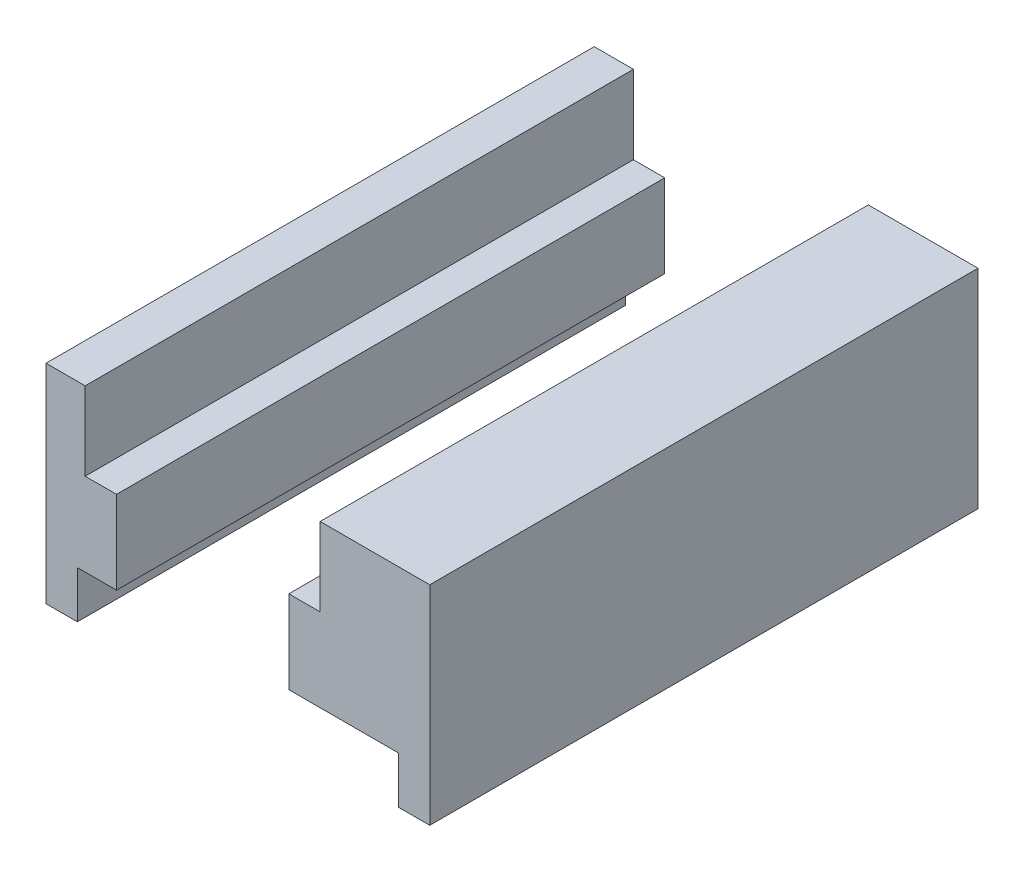
ISO-10303-21;
HEADER;
FILE_DESCRIPTION(('STEP AP214'),'2;1');
FILE_NAME('part.step','',(''),(''),'','','');
FILE_SCHEMA(('AUTOMOTIVE_DESIGN { 1 0 10303 214 1 1 1 1 }'));
ENDSEC;
DATA;
#1=APPLICATION_CONTEXT('core data for automotive mechanical design processes');
#2=APPLICATION_PROTOCOL_DEFINITION('international standard','automotive_design',2000,#1);
#3=PRODUCT_CONTEXT('',#1,'mechanical');
#4=PRODUCT('Part','Part','',(#3));
#5=PRODUCT_RELATED_PRODUCT_CATEGORY('part','',(#4));
#6=PRODUCT_DEFINITION_FORMATION('','',#4);
#7=PRODUCT_DEFINITION_CONTEXT('part definition',#1,'design');
#8=PRODUCT_DEFINITION('design','',#6,#7);
#9=PRODUCT_DEFINITION_SHAPE('','',#8);
#10=(LENGTH_UNIT() NAMED_UNIT(*) SI_UNIT(.MILLI.,.METRE.));
#11=(NAMED_UNIT(*) PLANE_ANGLE_UNIT() SI_UNIT($,.RADIAN.));
#12=(NAMED_UNIT(*) SI_UNIT($,.STERADIAN.) SOLID_ANGLE_UNIT());
#13=UNCERTAINTY_MEASURE_WITH_UNIT(LENGTH_MEASURE(1.E-05),#10,'distance_accuracy_value','');
#14=(GEOMETRIC_REPRESENTATION_CONTEXT(3) GLOBAL_UNCERTAINTY_ASSIGNED_CONTEXT((#13)) GLOBAL_UNIT_ASSIGNED_CONTEXT((#10,
#11,#12)) REPRESENTATION_CONTEXT('',''));
#15=CARTESIAN_POINT('',(0.,0.,0.));
#16=DIRECTION('',(0.,0.,1.));
#17=DIRECTION('',(1.,0.,0.));
#18=AXIS2_PLACEMENT_3D('',#15,#16,#17);
#19=CARTESIAN_POINT('',(12.25,0.,35.));
#20=DIRECTION('',(0.,1.,0.));
#21=DIRECTION('',(-1.,0.,0.));
#22=AXIS2_PLACEMENT_3D('',#19,#20,#21);
#23=PLANE('',#22);
#24=DIRECTION('',(1.,0.,0.));
#25=VECTOR('',#24,1.);
#26=CARTESIAN_POINT('',(12.25,0.,0.));
#27=LINE('',#26,#25);
#28=CARTESIAN_POINT('',(10.25,0.,0.));
#29=VERTEX_POINT('',#28);
#30=CARTESIAN_POINT('',(12.25,0.,0.));
#31=VERTEX_POINT('',#30);
#32=EDGE_CURVE('E12',#29,#31,#27,.T.);
#33=ORIENTED_EDGE('',*,*,#32,.T.);
#34=DIRECTION('',(0.,0.,-1.));
#35=VECTOR('',#34,1.);
#36=CARTESIAN_POINT('',(12.25,0.,35.));
#37=LINE('',#36,#35);
#38=CARTESIAN_POINT('',(12.25,0.,35.));
#39=VERTEX_POINT('',#38);
#40=EDGE_CURVE('E207',#39,#31,#37,.T.);
#41=ORIENTED_EDGE('',*,*,#40,.F.);
#42=DIRECTION('',(1.,0.,0.));
#43=VECTOR('',#42,1.);
#44=CARTESIAN_POINT('',(12.25,0.,35.));
#45=LINE('',#44,#43);
#46=CARTESIAN_POINT('',(10.25,0.,35.));
#47=VERTEX_POINT('',#46);
#48=EDGE_CURVE('E57',#47,#39,#45,.T.);
#49=ORIENTED_EDGE('',*,*,#48,.F.);
#50=DIRECTION('',(0.,0.,-1.));
#51=VECTOR('',#50,1.);
#52=CARTESIAN_POINT('',(10.25,0.,35.));
#53=LINE('',#52,#51);
#54=EDGE_CURVE('E164',#47,#29,#53,.T.);
#55=ORIENTED_EDGE('',*,*,#54,.T.);
#56=EDGE_LOOP('',(#33,#41,#49,#55));
#57=FACE_BOUND('',#56,.T.);
#58=ADVANCED_FACE('F53',(#57),#23,.F.);
#59=CARTESIAN_POINT('',(12.25,13.3,35.));
#60=DIRECTION('',(-1.,0.,0.));
#61=DIRECTION('',(0.,-1.,0.));
#62=AXIS2_PLACEMENT_3D('',#59,#60,#61);
#63=PLANE('',#62);
#64=DIRECTION('',(0.,1.,0.));
#65=VECTOR('',#64,1.);
#66=CARTESIAN_POINT('',(12.25,13.3,0.));
#67=LINE('',#66,#65);
#68=CARTESIAN_POINT('',(12.25,13.3,0.));
#69=VERTEX_POINT('',#68);
#70=EDGE_CURVE('E64',#31,#69,#67,.T.);
#71=ORIENTED_EDGE('',*,*,#70,.T.);
#72=DIRECTION('',(0.,0.,-1.));
#73=VECTOR('',#72,1.);
#74=CARTESIAN_POINT('',(12.25,13.3,35.));
#75=LINE('',#74,#73);
#76=CARTESIAN_POINT('',(12.25,13.3,35.));
#77=VERTEX_POINT('',#76);
#78=EDGE_CURVE('E134',#77,#69,#75,.T.);
#79=ORIENTED_EDGE('',*,*,#78,.F.);
#80=DIRECTION('',(0.,1.,0.));
#81=VECTOR('',#80,1.);
#82=CARTESIAN_POINT('',(12.25,13.3,35.));
#83=LINE('',#82,#81);
#84=EDGE_CURVE('E100',#39,#77,#83,.T.);
#85=ORIENTED_EDGE('',*,*,#84,.F.);
#86=ORIENTED_EDGE('',*,*,#40,.T.);
#87=EDGE_LOOP('',(#71,#79,#85,#86));
#88=FACE_BOUND('',#87,.T.);
#89=ADVANCED_FACE('F219',(#88),#63,.F.);
#90=CARTESIAN_POINT('',(5.25,13.3,35.));
#91=DIRECTION('',(0.,-1.,0.));
#92=DIRECTION('',(0.,0.,-1.));
#93=AXIS2_PLACEMENT_3D('',#90,#91,#92);
#94=PLANE('',#93);
#95=DIRECTION('',(-1.,0.,0.));
#96=VECTOR('',#95,1.);
#97=CARTESIAN_POINT('',(5.25,13.3,0.));
#98=LINE('',#97,#96);
#99=CARTESIAN_POINT('',(5.25,13.3,0.));
#100=VERTEX_POINT('',#99);
#101=EDGE_CURVE('E128',#69,#100,#98,.T.);
#102=ORIENTED_EDGE('',*,*,#101,.T.);
#103=DIRECTION('',(0.,0.,-1.));
#104=VECTOR('',#103,1.);
#105=CARTESIAN_POINT('',(5.25,13.3,35.));
#106=LINE('',#105,#104);
#107=CARTESIAN_POINT('',(5.25,13.3,35.));
#108=VERTEX_POINT('',#107);
#109=EDGE_CURVE('E132',#108,#100,#106,.T.);
#110=ORIENTED_EDGE('',*,*,#109,.F.);
#111=DIRECTION('',(-1.,0.,0.));
#112=VECTOR('',#111,1.);
#113=CARTESIAN_POINT('',(5.25,13.3,35.));
#114=LINE('',#113,#112);
#115=EDGE_CURVE('E175',#77,#108,#114,.T.);
#116=ORIENTED_EDGE('',*,*,#115,.F.);
#117=ORIENTED_EDGE('',*,*,#78,.T.);
#118=EDGE_LOOP('',(#102,#110,#116,#117));
#119=FACE_BOUND('',#118,.T.);
#120=ADVANCED_FACE('F130',(#119),#94,.F.);
#121=CARTESIAN_POINT('',(5.25,8.3,35.));
#122=DIRECTION('',(1.,0.,0.));
#123=DIRECTION('',(0.,0.,-1.));
#124=AXIS2_PLACEMENT_3D('',#121,#122,#123);
#125=PLANE('',#124);
#126=DIRECTION('',(0.,-1.,0.));
#127=VECTOR('',#126,1.);
#128=CARTESIAN_POINT('',(5.25,8.3,0.));
#129=LINE('',#128,#127);
#130=CARTESIAN_POINT('',(5.25,8.3,0.));
#131=VERTEX_POINT('',#130);
#132=EDGE_CURVE('E137',#100,#131,#129,.T.);
#133=ORIENTED_EDGE('',*,*,#132,.T.);
#134=DIRECTION('',(0.,0.,-1.));
#135=VECTOR('',#134,1.);
#136=CARTESIAN_POINT('',(5.25,8.3,35.));
#137=LINE('',#136,#135);
#138=CARTESIAN_POINT('',(5.25,8.3,35.));
#139=VERTEX_POINT('',#138);
#140=EDGE_CURVE('E145',#139,#131,#137,.T.);
#141=ORIENTED_EDGE('',*,*,#140,.F.);
#142=DIRECTION('',(0.,-1.,0.));
#143=VECTOR('',#142,1.);
#144=CARTESIAN_POINT('',(5.25,8.3,35.));
#145=LINE('',#144,#143);
#146=EDGE_CURVE('E143',#108,#139,#145,.T.);
#147=ORIENTED_EDGE('',*,*,#146,.F.);
#148=ORIENTED_EDGE('',*,*,#109,.T.);
#149=EDGE_LOOP('',(#133,#141,#147,#148));
#150=FACE_BOUND('',#149,.T.);
#151=ADVANCED_FACE('F140',(#150),#125,.F.);
#152=CARTESIAN_POINT('',(3.25,8.3,35.));
#153=DIRECTION('',(0.,-1.,0.));
#154=DIRECTION('',(0.,0.,-1.));
#155=AXIS2_PLACEMENT_3D('',#152,#153,#154);
#156=PLANE('',#155);
#157=DIRECTION('',(-1.,0.,0.));
#158=VECTOR('',#157,1.);
#159=CARTESIAN_POINT('',(3.25,8.3,0.));
#160=LINE('',#159,#158);
#161=CARTESIAN_POINT('',(3.25,8.3,0.));
#162=VERTEX_POINT('',#161);
#163=EDGE_CURVE('E150',#131,#162,#160,.T.);
#164=ORIENTED_EDGE('',*,*,#163,.T.);
#165=DIRECTION('',(0.,0.,-1.));
#166=VECTOR('',#165,1.);
#167=CARTESIAN_POINT('',(3.25,8.3,35.));
#168=LINE('',#167,#166);
#169=CARTESIAN_POINT('',(3.25,8.3,35.));
#170=VERTEX_POINT('',#169);
#171=EDGE_CURVE('E198',#170,#162,#168,.T.);
#172=ORIENTED_EDGE('',*,*,#171,.F.);
#173=DIRECTION('',(-1.,0.,0.));
#174=VECTOR('',#173,1.);
#175=CARTESIAN_POINT('',(3.25,8.3,35.));
#176=LINE('',#175,#174);
#177=EDGE_CURVE('E170',#139,#170,#176,.T.);
#178=ORIENTED_EDGE('',*,*,#177,.F.);
#179=ORIENTED_EDGE('',*,*,#140,.T.);
#180=EDGE_LOOP('',(#164,#172,#178,#179));
#181=FACE_BOUND('',#180,.T.);
#182=ADVANCED_FACE('F222',(#181),#156,.F.);
#183=CARTESIAN_POINT('',(3.25,3.,35.));
#184=DIRECTION('',(1.,0.,0.));
#185=DIRECTION('',(0.,0.,-1.));
#186=AXIS2_PLACEMENT_3D('',#183,#184,#185);
#187=PLANE('',#186);
#188=DIRECTION('',(0.,-1.,0.));
#189=VECTOR('',#188,1.);
#190=CARTESIAN_POINT('',(3.25,3.,0.));
#191=LINE('',#190,#189);
#192=CARTESIAN_POINT('',(3.25,3.,0.));
#193=VERTEX_POINT('',#192);
#194=EDGE_CURVE('E154',#162,#193,#191,.T.);
#195=ORIENTED_EDGE('',*,*,#194,.T.);
#196=DIRECTION('',(0.,0.,-1.));
#197=VECTOR('',#196,1.);
#198=CARTESIAN_POINT('',(3.25,3.,35.));
#199=LINE('',#198,#197);
#200=CARTESIAN_POINT('',(3.25,3.,35.));
#201=VERTEX_POINT('',#200);
#202=EDGE_CURVE('E195',#201,#193,#199,.T.);
#203=ORIENTED_EDGE('',*,*,#202,.F.);
#204=DIRECTION('',(0.,-1.,0.));
#205=VECTOR('',#204,1.);
#206=CARTESIAN_POINT('',(3.25,3.,35.));
#207=LINE('',#206,#205);
#208=EDGE_CURVE('E167',#170,#201,#207,.T.);
#209=ORIENTED_EDGE('',*,*,#208,.F.);
#210=ORIENTED_EDGE('',*,*,#171,.T.);
#211=EDGE_LOOP('',(#195,#203,#209,#210));
#212=FACE_BOUND('',#211,.T.);
#213=ADVANCED_FACE('F193',(#212),#187,.F.);
#214=CARTESIAN_POINT('',(10.25,3.,35.));
#215=DIRECTION('',(0.,1.,0.));
#216=DIRECTION('',(-1.,0.,0.));
#217=AXIS2_PLACEMENT_3D('',#214,#215,#216);
#218=PLANE('',#217);
#219=DIRECTION('',(1.,0.,0.));
#220=VECTOR('',#219,1.);
#221=CARTESIAN_POINT('',(10.25,3.,0.));
#222=LINE('',#221,#220);
#223=CARTESIAN_POINT('',(10.25,3.,0.));
#224=VERTEX_POINT('',#223);
#225=EDGE_CURVE('E182',#193,#224,#222,.T.);
#226=ORIENTED_EDGE('',*,*,#225,.T.);
#227=DIRECTION('',(0.,0.,-1.));
#228=VECTOR('',#227,1.);
#229=CARTESIAN_POINT('',(10.25,3.,35.));
#230=LINE('',#229,#228);
#231=CARTESIAN_POINT('',(10.25,3.,35.));
#232=VERTEX_POINT('',#231);
#233=EDGE_CURVE('E204',#232,#224,#230,.T.);
#234=ORIENTED_EDGE('',*,*,#233,.F.);
#235=DIRECTION('',(1.,0.,0.));
#236=VECTOR('',#235,1.);
#237=CARTESIAN_POINT('',(10.25,3.,35.));
#238=LINE('',#237,#236);
#239=EDGE_CURVE('E163',#201,#232,#238,.T.);
#240=ORIENTED_EDGE('',*,*,#239,.F.);
#241=ORIENTED_EDGE('',*,*,#202,.T.);
#242=EDGE_LOOP('',(#226,#234,#240,#241));
#243=FACE_BOUND('',#242,.T.);
#244=ADVANCED_FACE('F201',(#243),#218,.F.);
#245=CARTESIAN_POINT('',(10.25,0.,35.));
#246=DIRECTION('',(1.,0.,0.));
#247=DIRECTION('',(0.,0.,-1.));
#248=AXIS2_PLACEMENT_3D('',#245,#246,#247);
#249=PLANE('',#248);
#250=DIRECTION('',(0.,-1.,0.));
#251=VECTOR('',#250,1.);
#252=CARTESIAN_POINT('',(10.25,0.,0.));
#253=LINE('',#252,#251);
#254=EDGE_CURVE('E111',#224,#29,#253,.T.);
#255=ORIENTED_EDGE('',*,*,#254,.T.);
#256=ORIENTED_EDGE('',*,*,#54,.F.);
#257=DIRECTION('',(0.,-1.,0.));
#258=VECTOR('',#257,1.);
#259=CARTESIAN_POINT('',(10.25,0.,35.));
#260=LINE('',#259,#258);
#261=EDGE_CURVE('E160',#232,#47,#260,.T.);
#262=ORIENTED_EDGE('',*,*,#261,.F.);
#263=ORIENTED_EDGE('',*,*,#233,.T.);
#264=EDGE_LOOP('',(#255,#256,#262,#263));
#265=FACE_BOUND('',#264,.T.);
#266=ADVANCED_FACE('F223',(#265),#249,.F.);
#267=CARTESIAN_POINT('',(0.,0.,35.));
#268=DIRECTION('',(0.,0.,-1.));
#269=DIRECTION('',(-1.,0.,0.));
#270=AXIS2_PLACEMENT_3D('',#267,#268,#269);
#271=PLANE('',#270);
#272=ORIENTED_EDGE('',*,*,#48,.T.);
#273=ORIENTED_EDGE('',*,*,#84,.T.);
#274=ORIENTED_EDGE('',*,*,#115,.T.);
#275=ORIENTED_EDGE('',*,*,#146,.T.);
#276=ORIENTED_EDGE('',*,*,#177,.T.);
#277=ORIENTED_EDGE('',*,*,#208,.T.);
#278=ORIENTED_EDGE('',*,*,#239,.T.);
#279=ORIENTED_EDGE('',*,*,#261,.T.);
#280=EDGE_LOOP('',(#272,#273,#274,#275,#276,#277,#278,#279));
#281=FACE_BOUND('',#280,.T.);
#282=ADVANCED_FACE('F55',(#281),#271,.F.);
#283=CARTESIAN_POINT('',(0.,0.,0.));
#284=DIRECTION('',(0.,0.,-1.));
#285=DIRECTION('',(-1.,0.,0.));
#286=AXIS2_PLACEMENT_3D('',#283,#284,#285);
#287=PLANE('',#286);
#288=ORIENTED_EDGE('',*,*,#32,.F.);
#289=ORIENTED_EDGE('',*,*,#254,.F.);
#290=ORIENTED_EDGE('',*,*,#225,.F.);
#291=ORIENTED_EDGE('',*,*,#194,.F.);
#292=ORIENTED_EDGE('',*,*,#163,.F.);
#293=ORIENTED_EDGE('',*,*,#132,.F.);
#294=ORIENTED_EDGE('',*,*,#101,.F.);
#295=ORIENTED_EDGE('',*,*,#70,.F.);
#296=EDGE_LOOP('',(#288,#289,#290,#291,#292,#293,#294,#295));
#297=FACE_BOUND('',#296,.T.);
#298=ADVANCED_FACE('F148',(#297),#287,.T.);
#299=CLOSED_SHELL('',(#58,#89,#120,#151,#182,#213,#244,#266,#282,#298));
#300=MANIFOLD_SOLID_BREP('B2',#299);
#301=CARTESIAN_POINT('',(-12.25,13.3,35.));
#302=DIRECTION('',(1.,0.,0.));
#303=DIRECTION('',(0.,1.,0.));
#304=AXIS2_PLACEMENT_3D('',#301,#302,#303);
#305=PLANE('',#304);
#306=DIRECTION('',(0.,-1.,0.));
#307=VECTOR('',#306,1.);
#308=CARTESIAN_POINT('',(-12.25,13.3,0.));
#309=LINE('',#308,#307);
#310=CARTESIAN_POINT('',(-12.25,13.3,0.));
#311=VERTEX_POINT('',#310);
#312=CARTESIAN_POINT('',(-12.25,0.,0.));
#313=VERTEX_POINT('',#312);
#314=EDGE_CURVE('E421',#311,#313,#309,.T.);
#315=ORIENTED_EDGE('',*,*,#314,.T.);
#316=DIRECTION('',(0.,0.,-1.));
#317=VECTOR('',#316,1.);
#318=CARTESIAN_POINT('',(-12.25,0.,35.));
#319=LINE('',#318,#317);
#320=CARTESIAN_POINT('',(-12.25,0.,35.));
#321=VERTEX_POINT('',#320);
#322=EDGE_CURVE('E51',#321,#313,#319,.T.);
#323=ORIENTED_EDGE('',*,*,#322,.F.);
#324=DIRECTION('',(0.,-1.,0.));
#325=VECTOR('',#324,1.);
#326=CARTESIAN_POINT('',(-12.25,13.3,35.));
#327=LINE('',#326,#325);
#328=CARTESIAN_POINT('',(-12.25,13.3,35.));
#329=VERTEX_POINT('',#328);
#330=EDGE_CURVE('E435',#329,#321,#327,.T.);
#331=ORIENTED_EDGE('',*,*,#330,.F.);
#332=DIRECTION('',(0.,0.,-1.));
#333=VECTOR('',#332,1.);
#334=CARTESIAN_POINT('',(-12.25,13.3,35.));
#335=LINE('',#334,#333);
#336=EDGE_CURVE('E417',#329,#311,#335,.T.);
#337=ORIENTED_EDGE('',*,*,#336,.T.);
#338=EDGE_LOOP('',(#315,#323,#331,#337));
#339=FACE_BOUND('',#338,.T.);
#340=ADVANCED_FACE('F325',(#339),#305,.F.);
#341=CARTESIAN_POINT('',(-12.25,0.,35.));
#342=DIRECTION('',(0.,1.,0.));
#343=DIRECTION('',(0.,0.,1.));
#344=AXIS2_PLACEMENT_3D('',#341,#342,#343);
#345=PLANE('',#344);
#346=DIRECTION('',(1.,0.,0.));
#347=VECTOR('',#346,1.);
#348=CARTESIAN_POINT('',(-12.25,0.,0.));
#349=LINE('',#348,#347);
#350=CARTESIAN_POINT('',(-10.25,0.,0.));
#351=VERTEX_POINT('',#350);
#352=EDGE_CURVE('E424',#313,#351,#349,.T.);
#353=ORIENTED_EDGE('',*,*,#352,.T.);
#354=DIRECTION('',(0.,0.,-1.));
#355=VECTOR('',#354,1.);
#356=CARTESIAN_POINT('',(-10.25,0.,35.));
#357=LINE('',#356,#355);
#358=CARTESIAN_POINT('',(-10.25,0.,35.));
#359=VERTEX_POINT('',#358);
#360=EDGE_CURVE('E333',#359,#351,#357,.T.);
#361=ORIENTED_EDGE('',*,*,#360,.F.);
#362=DIRECTION('',(1.,0.,0.));
#363=VECTOR('',#362,1.);
#364=CARTESIAN_POINT('',(-12.25,0.,35.));
#365=LINE('',#364,#363);
#366=EDGE_CURVE('E384',#321,#359,#365,.T.);
#367=ORIENTED_EDGE('',*,*,#366,.F.);
#368=ORIENTED_EDGE('',*,*,#322,.T.);
#369=EDGE_LOOP('',(#353,#361,#367,#368));
#370=FACE_BOUND('',#369,.T.);
#371=ADVANCED_FACE('F470',(#370),#345,.F.);
#372=CARTESIAN_POINT('',(-10.25,3.,35.));
#373=DIRECTION('',(-1.,0.,0.));
#374=DIRECTION('',(0.,0.,1.));
#375=AXIS2_PLACEMENT_3D('',#372,#373,#374);
#376=PLANE('',#375);
#377=DIRECTION('',(0.,1.,0.));
#378=VECTOR('',#377,1.);
#379=CARTESIAN_POINT('',(-10.25,3.,0.));
#380=LINE('',#379,#378);
#381=CARTESIAN_POINT('',(-10.25,3.,0.));
#382=VERTEX_POINT('',#381);
#383=EDGE_CURVE('E426',#351,#382,#380,.T.);
#384=ORIENTED_EDGE('',*,*,#383,.T.);
#385=DIRECTION('',(0.,0.,-1.));
#386=VECTOR('',#385,1.);
#387=CARTESIAN_POINT('',(-10.25,3.,35.));
#388=LINE('',#387,#386);
#389=CARTESIAN_POINT('',(-10.25,3.,35.));
#390=VERTEX_POINT('',#389);
#391=EDGE_CURVE('E442',#390,#382,#388,.T.);
#392=ORIENTED_EDGE('',*,*,#391,.F.);
#393=DIRECTION('',(0.,1.,0.));
#394=VECTOR('',#393,1.);
#395=CARTESIAN_POINT('',(-10.25,3.,35.));
#396=LINE('',#395,#394);
#397=EDGE_CURVE('E450',#359,#390,#396,.T.);
#398=ORIENTED_EDGE('',*,*,#397,.F.);
#399=ORIENTED_EDGE('',*,*,#360,.T.);
#400=EDGE_LOOP('',(#384,#392,#398,#399));
#401=FACE_BOUND('',#400,.T.);
#402=ADVANCED_FACE('F448',(#401),#376,.F.);
#403=CARTESIAN_POINT('',(-7.75,3.,35.));
#404=DIRECTION('',(0.,1.,0.));
#405=DIRECTION('',(-1.,0.,0.));
#406=AXIS2_PLACEMENT_3D('',#403,#404,#405);
#407=PLANE('',#406);
#408=DIRECTION('',(1.,0.,0.));
#409=VECTOR('',#408,1.);
#410=CARTESIAN_POINT('',(-7.75,3.,0.));
#411=LINE('',#410,#409);
#412=CARTESIAN_POINT('',(-7.75,3.,0.));
#413=VERTEX_POINT('',#412);
#414=EDGE_CURVE('E428',#382,#413,#411,.T.);
#415=ORIENTED_EDGE('',*,*,#414,.T.);
#416=DIRECTION('',(0.,0.,-1.));
#417=VECTOR('',#416,1.);
#418=CARTESIAN_POINT('',(-7.75,3.,35.));
#419=LINE('',#418,#417);
#420=CARTESIAN_POINT('',(-7.75,3.,35.));
#421=VERTEX_POINT('',#420);
#422=EDGE_CURVE('E439',#421,#413,#419,.T.);
#423=ORIENTED_EDGE('',*,*,#422,.F.);
#424=DIRECTION('',(1.,0.,0.));
#425=VECTOR('',#424,1.);
#426=CARTESIAN_POINT('',(-7.75,3.,35.));
#427=LINE('',#426,#425);
#428=EDGE_CURVE('E462',#390,#421,#427,.T.);
#429=ORIENTED_EDGE('',*,*,#428,.F.);
#430=ORIENTED_EDGE('',*,*,#391,.T.);
#431=EDGE_LOOP('',(#415,#423,#429,#430));
#432=FACE_BOUND('',#431,.T.);
#433=ADVANCED_FACE('F458',(#432),#407,.F.);
#434=CARTESIAN_POINT('',(-7.75,8.3,35.));
#435=DIRECTION('',(-1.,0.,0.));
#436=DIRECTION('',(0.,-1.,0.));
#437=AXIS2_PLACEMENT_3D('',#434,#435,#436);
#438=PLANE('',#437);
#439=DIRECTION('',(0.,1.,0.));
#440=VECTOR('',#439,1.);
#441=CARTESIAN_POINT('',(-7.75,8.3,0.));
#442=LINE('',#441,#440);
#443=CARTESIAN_POINT('',(-7.75,8.3,0.));
#444=VERTEX_POINT('',#443);
#445=EDGE_CURVE('E430',#413,#444,#442,.T.);
#446=ORIENTED_EDGE('',*,*,#445,.T.);
#447=DIRECTION('',(0.,0.,-1.));
#448=VECTOR('',#447,1.);
#449=CARTESIAN_POINT('',(-7.75,8.3,35.));
#450=LINE('',#449,#448);
#451=CARTESIAN_POINT('',(-7.75,8.3,35.));
#452=VERTEX_POINT('',#451);
#453=EDGE_CURVE('E412',#452,#444,#450,.T.);
#454=ORIENTED_EDGE('',*,*,#453,.F.);
#455=DIRECTION('',(0.,1.,0.));
#456=VECTOR('',#455,1.);
#457=CARTESIAN_POINT('',(-7.75,8.3,35.));
#458=LINE('',#457,#456);
#459=EDGE_CURVE('E403',#421,#452,#458,.T.);
#460=ORIENTED_EDGE('',*,*,#459,.F.);
#461=ORIENTED_EDGE('',*,*,#422,.T.);
#462=EDGE_LOOP('',(#446,#454,#460,#461));
#463=FACE_BOUND('',#462,.T.);
#464=ADVANCED_FACE('F461',(#463),#438,.F.);
#465=CARTESIAN_POINT('',(-7.75,8.3,35.));
#466=DIRECTION('',(0.,-1.,0.));
#467=DIRECTION('',(0.,0.,-1.));
#468=AXIS2_PLACEMENT_3D('',#465,#466,#467);
#469=PLANE('',#468);
#470=DIRECTION('',(-1.,0.,0.));
#471=VECTOR('',#470,1.);
#472=CARTESIAN_POINT('',(-7.75,8.3,0.));
#473=LINE('',#472,#471);
#474=CARTESIAN_POINT('',(-9.75,8.3,0.));
#475=VERTEX_POINT('',#474);
#476=EDGE_CURVE('E411',#444,#475,#473,.T.);
#477=ORIENTED_EDGE('',*,*,#476,.T.);
#478=DIRECTION('',(0.,0.,-1.));
#479=VECTOR('',#478,1.);
#480=CARTESIAN_POINT('',(-9.75,8.3,35.));
#481=LINE('',#480,#479);
#482=CARTESIAN_POINT('',(-9.75,8.3,35.));
#483=VERTEX_POINT('',#482);
#484=EDGE_CURVE('E408',#483,#475,#481,.T.);
#485=ORIENTED_EDGE('',*,*,#484,.F.);
#486=DIRECTION('',(-1.,0.,0.));
#487=VECTOR('',#486,1.);
#488=CARTESIAN_POINT('',(-7.75,8.3,35.));
#489=LINE('',#488,#487);
#490=EDGE_CURVE('E397',#452,#483,#489,.T.);
#491=ORIENTED_EDGE('',*,*,#490,.F.);
#492=ORIENTED_EDGE('',*,*,#453,.T.);
#493=EDGE_LOOP('',(#477,#485,#491,#492));
#494=FACE_BOUND('',#493,.T.);
#495=ADVANCED_FACE('F409',(#494),#469,.F.);
#496=CARTESIAN_POINT('',(-9.75,8.3,35.));
#497=DIRECTION('',(-1.,0.,0.));
#498=DIRECTION('',(0.,0.,1.));
#499=AXIS2_PLACEMENT_3D('',#496,#497,#498);
#500=PLANE('',#499);
#501=DIRECTION('',(0.,1.,0.));
#502=VECTOR('',#501,1.);
#503=CARTESIAN_POINT('',(-9.75,8.3,0.));
#504=LINE('',#503,#502);
#505=CARTESIAN_POINT('',(-9.75,13.3,0.));
#506=VERTEX_POINT('',#505);
#507=EDGE_CURVE('E370',#475,#506,#504,.T.);
#508=ORIENTED_EDGE('',*,*,#507,.T.);
#509=DIRECTION('',(0.,0.,-1.));
#510=VECTOR('',#509,1.);
#511=CARTESIAN_POINT('',(-9.75,13.3,35.));
#512=LINE('',#511,#510);
#513=CARTESIAN_POINT('',(-9.75,13.3,35.));
#514=VERTEX_POINT('',#513);
#515=EDGE_CURVE('E413',#514,#506,#512,.T.);
#516=ORIENTED_EDGE('',*,*,#515,.F.);
#517=DIRECTION('',(0.,1.,0.));
#518=VECTOR('',#517,1.);
#519=CARTESIAN_POINT('',(-9.75,8.3,35.));
#520=LINE('',#519,#518);
#521=EDGE_CURVE('E401',#483,#514,#520,.T.);
#522=ORIENTED_EDGE('',*,*,#521,.F.);
#523=ORIENTED_EDGE('',*,*,#484,.T.);
#524=EDGE_LOOP('',(#508,#516,#522,#523));
#525=FACE_BOUND('',#524,.T.);
#526=ADVANCED_FACE('F415',(#525),#500,.F.);
#527=CARTESIAN_POINT('',(-9.75,13.3,35.));
#528=DIRECTION('',(0.,-1.,0.));
#529=DIRECTION('',(0.,0.,-1.));
#530=AXIS2_PLACEMENT_3D('',#527,#528,#529);
#531=PLANE('',#530);
#532=DIRECTION('',(-1.,0.,0.));
#533=VECTOR('',#532,1.);
#534=CARTESIAN_POINT('',(-9.75,13.3,0.));
#535=LINE('',#534,#533);
#536=EDGE_CURVE('E376',#506,#311,#535,.T.);
#537=ORIENTED_EDGE('',*,*,#536,.T.);
#538=ORIENTED_EDGE('',*,*,#336,.F.);
#539=DIRECTION('',(-1.,0.,0.));
#540=VECTOR('',#539,1.);
#541=CARTESIAN_POINT('',(-9.75,13.3,35.));
#542=LINE('',#541,#540);
#543=EDGE_CURVE('E341',#514,#329,#542,.T.);
#544=ORIENTED_EDGE('',*,*,#543,.F.);
#545=ORIENTED_EDGE('',*,*,#515,.T.);
#546=EDGE_LOOP('',(#537,#538,#544,#545));
#547=FACE_BOUND('',#546,.T.);
#548=ADVANCED_FACE('F486',(#547),#531,.F.);
#549=CARTESIAN_POINT('',(0.,0.,35.));
#550=DIRECTION('',(0.,0.,1.));
#551=DIRECTION('',(1.,0.,0.));
#552=AXIS2_PLACEMENT_3D('',#549,#550,#551);
#553=PLANE('',#552);
#554=ORIENTED_EDGE('',*,*,#330,.T.);
#555=ORIENTED_EDGE('',*,*,#366,.T.);
#556=ORIENTED_EDGE('',*,*,#397,.T.);
#557=ORIENTED_EDGE('',*,*,#428,.T.);
#558=ORIENTED_EDGE('',*,*,#459,.T.);
#559=ORIENTED_EDGE('',*,*,#490,.T.);
#560=ORIENTED_EDGE('',*,*,#521,.T.);
#561=ORIENTED_EDGE('',*,*,#543,.T.);
#562=EDGE_LOOP('',(#554,#555,#556,#557,#558,#559,#560,#561));
#563=FACE_BOUND('',#562,.T.);
#564=ADVANCED_FACE('F399',(#563),#553,.T.);
#565=CARTESIAN_POINT('',(0.,0.,0.));
#566=DIRECTION('',(0.,0.,1.));
#567=DIRECTION('',(1.,0.,0.));
#568=AXIS2_PLACEMENT_3D('',#565,#566,#567);
#569=PLANE('',#568);
#570=ORIENTED_EDGE('',*,*,#314,.F.);
#571=ORIENTED_EDGE('',*,*,#536,.F.);
#572=ORIENTED_EDGE('',*,*,#507,.F.);
#573=ORIENTED_EDGE('',*,*,#476,.F.);
#574=ORIENTED_EDGE('',*,*,#445,.F.);
#575=ORIENTED_EDGE('',*,*,#414,.F.);
#576=ORIENTED_EDGE('',*,*,#383,.F.);
#577=ORIENTED_EDGE('',*,*,#352,.F.);
#578=EDGE_LOOP('',(#570,#571,#572,#573,#574,#575,#576,#577));
#579=FACE_BOUND('',#578,.T.);
#580=ADVANCED_FACE('F454',(#579),#569,.F.);
#581=CLOSED_SHELL('',(#340,#371,#402,#433,#464,#495,#526,#548,#564,#580));
#582=MANIFOLD_SOLID_BREP('B6',#581);
#583=ADVANCED_BREP_SHAPE_REPRESENTATION('',(#18,#300,#582),#14);
#584=SHAPE_DEFINITION_REPRESENTATION(#9,#583);
ENDSEC;
END-ISO-10303-21;
